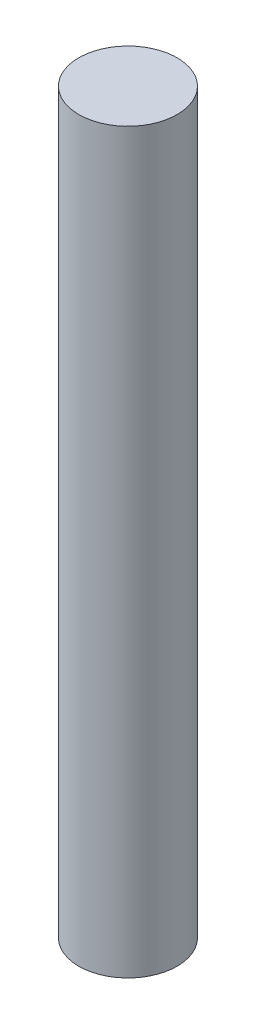
ISO-10303-21;
HEADER;
FILE_DESCRIPTION(('STEP AP214'),'2;1');
FILE_NAME('part.step','',(''),(''),'','','');
FILE_SCHEMA(('AUTOMOTIVE_DESIGN { 1 0 10303 214 1 1 1 1 }'));
ENDSEC;
DATA;
#1=APPLICATION_CONTEXT('core data for automotive mechanical design processes');
#2=APPLICATION_PROTOCOL_DEFINITION('international standard','automotive_design',2000,#1);
#3=PRODUCT_CONTEXT('',#1,'mechanical');
#4=PRODUCT('Part','Part','',(#3));
#5=PRODUCT_RELATED_PRODUCT_CATEGORY('part','',(#4));
#6=PRODUCT_DEFINITION_FORMATION('','',#4);
#7=PRODUCT_DEFINITION_CONTEXT('part definition',#1,'design');
#8=PRODUCT_DEFINITION('design','',#6,#7);
#9=PRODUCT_DEFINITION_SHAPE('','',#8);
#10=(LENGTH_UNIT() NAMED_UNIT(*) SI_UNIT(.MILLI.,.METRE.));
#11=(NAMED_UNIT(*) PLANE_ANGLE_UNIT() SI_UNIT($,.RADIAN.));
#12=(NAMED_UNIT(*) SI_UNIT($,.STERADIAN.) SOLID_ANGLE_UNIT());
#13=UNCERTAINTY_MEASURE_WITH_UNIT(LENGTH_MEASURE(1.E-05),#10,'distance_accuracy_value','');
#14=(GEOMETRIC_REPRESENTATION_CONTEXT(3) GLOBAL_UNCERTAINTY_ASSIGNED_CONTEXT((#13)) GLOBAL_UNIT_ASSIGNED_CONTEXT((#10,
#11,#12)) REPRESENTATION_CONTEXT('',''));
#15=CARTESIAN_POINT('',(0.,0.,0.));
#16=DIRECTION('',(0.,0.,1.));
#17=DIRECTION('',(1.,0.,0.));
#18=AXIS2_PLACEMENT_3D('',#15,#16,#17);
#19=CARTESIAN_POINT('',(0.,150.,0.));
#20=DIRECTION('',(0.,-1.,0.));
#21=DIRECTION('',(0.,0.,-1.));
#22=AXIS2_PLACEMENT_3D('',#19,#20,#21);
#23=CYLINDRICAL_SURFACE('',#22,10.);
#24=CARTESIAN_POINT('',(0.,150.,0.));
#25=DIRECTION('',(0.,1.,0.));
#26=DIRECTION('',(0.,0.,1.));
#27=AXIS2_PLACEMENT_3D('',#24,#25,#26);
#28=CIRCLE('',#27,10.);
#29=CARTESIAN_POINT('',(0.,150.,10.));
#30=VERTEX_POINT('',#29);
#31=EDGE_CURVE('E10',#30,#30,#28,.T.);
#32=ORIENTED_EDGE('',*,*,#31,.F.);
#33=EDGE_LOOP('',(#32));
#34=FACE_BOUND('',#33,.T.);
#35=CARTESIAN_POINT('',(0.,0.,0.));
#36=DIRECTION('',(0.,1.,0.));
#37=DIRECTION('',(0.,0.,1.));
#38=AXIS2_PLACEMENT_3D('',#35,#36,#37);
#39=CIRCLE('',#38,10.);
#40=CARTESIAN_POINT('',(0.,0.,10.));
#41=VERTEX_POINT('',#40);
#42=EDGE_CURVE('E34',#41,#41,#39,.T.);
#43=ORIENTED_EDGE('',*,*,#42,.T.);
#44=EDGE_LOOP('',(#43));
#45=FACE_BOUND('',#44,.T.);
#46=ADVANCED_FACE('F31',(#34,#45),#23,.T.);
#47=CARTESIAN_POINT('',(0.,150.,0.));
#48=DIRECTION('',(0.,1.,0.));
#49=DIRECTION('',(0.,0.,1.));
#50=AXIS2_PLACEMENT_3D('',#47,#48,#49);
#51=PLANE('',#50);
#52=ORIENTED_EDGE('',*,*,#31,.T.);
#53=EDGE_LOOP('',(#52));
#54=FACE_BOUND('',#53,.T.);
#55=ADVANCED_FACE('F46',(#54),#51,.T.);
#56=CARTESIAN_POINT('',(0.,0.,0.));
#57=DIRECTION('',(0.,1.,0.));
#58=DIRECTION('',(0.,0.,1.));
#59=AXIS2_PLACEMENT_3D('',#56,#57,#58);
#60=PLANE('',#59);
#61=ORIENTED_EDGE('',*,*,#42,.F.);
#62=EDGE_LOOP('',(#61));
#63=FACE_BOUND('',#62,.T.);
#64=ADVANCED_FACE('F44',(#63),#60,.F.);
#65=CLOSED_SHELL('',(#46,#55,#64));
#66=MANIFOLD_SOLID_BREP('B2',#65);
#67=ADVANCED_BREP_SHAPE_REPRESENTATION('',(#18,#66),#14);
#68=SHAPE_DEFINITION_REPRESENTATION(#9,#67);
ENDSEC;
END-ISO-10303-21;
